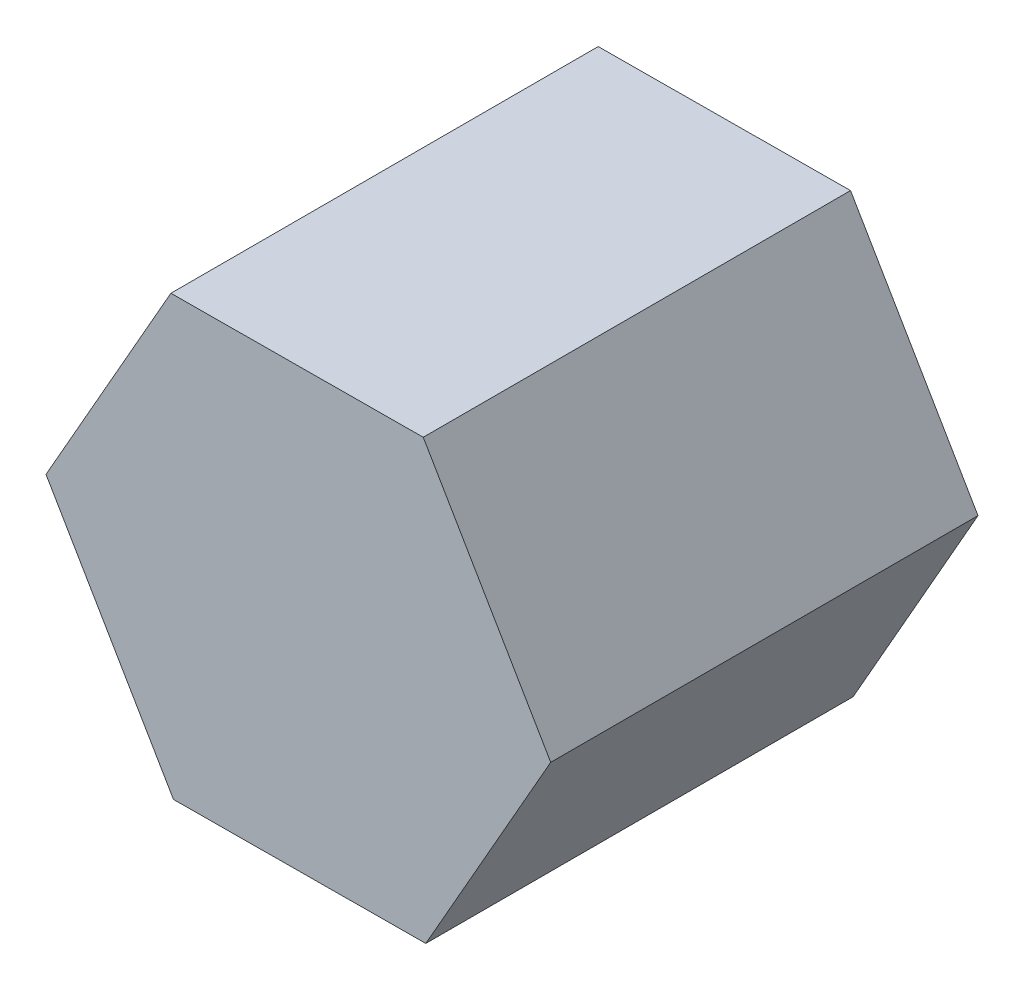
ISO-10303-21;
HEADER;
FILE_DESCRIPTION(('STEP AP214'),'2;1');
FILE_NAME('part.step','',(''),(''),'','','');
FILE_SCHEMA(('AUTOMOTIVE_DESIGN { 1 0 10303 214 1 1 1 1 }'));
ENDSEC;
DATA;
#1=APPLICATION_CONTEXT('core data for automotive mechanical design processes');
#2=APPLICATION_PROTOCOL_DEFINITION('international standard','automotive_design',2000,#1);
#3=PRODUCT_CONTEXT('',#1,'mechanical');
#4=PRODUCT('Part','Part','',(#3));
#5=PRODUCT_RELATED_PRODUCT_CATEGORY('part','',(#4));
#6=PRODUCT_DEFINITION_FORMATION('','',#4);
#7=PRODUCT_DEFINITION_CONTEXT('part definition',#1,'design');
#8=PRODUCT_DEFINITION('design','',#6,#7);
#9=PRODUCT_DEFINITION_SHAPE('','',#8);
#10=(LENGTH_UNIT() NAMED_UNIT(*) SI_UNIT(.MILLI.,.METRE.));
#11=(NAMED_UNIT(*) PLANE_ANGLE_UNIT() SI_UNIT($,.RADIAN.));
#12=(NAMED_UNIT(*) SI_UNIT($,.STERADIAN.) SOLID_ANGLE_UNIT());
#13=UNCERTAINTY_MEASURE_WITH_UNIT(LENGTH_MEASURE(1.E-05),#10,'distance_accuracy_value','');
#14=(GEOMETRIC_REPRESENTATION_CONTEXT(3) GLOBAL_UNCERTAINTY_ASSIGNED_CONTEXT((#13)) GLOBAL_UNIT_ASSIGNED_CONTEXT((#10,
#11,#12)) REPRESENTATION_CONTEXT('',''));
#15=CARTESIAN_POINT('',(0.,0.,0.));
#16=DIRECTION('',(0.,0.,1.));
#17=DIRECTION('',(1.,0.,0.));
#18=AXIS2_PLACEMENT_3D('',#15,#16,#17);
#19=CARTESIAN_POINT('',(46.7699203692853,82.114703608128,160.));
#20=DIRECTION('',(0.00585621832050526,-0.999982852206468,0.));
#21=DIRECTION('',(0.999982852206468,0.00585621832050526,0.));
#22=AXIS2_PLACEMENT_3D('',#19,#20,#21);
#23=PLANE('',#22);
#24=DIRECTION('',(-0.999982852206468,-0.00585621832050526,0.));
#25=VECTOR('',#24,1.);
#26=CARTESIAN_POINT('',(46.7699203692853,82.114703608128,0.));
#27=LINE('',#26,#25);
#28=CARTESIAN_POINT('',(46.7699203692853,82.114703608128,0.));
#29=VERTEX_POINT('',#28);
#30=CARTESIAN_POINT('',(-47.728459164226,81.5612909768403,0.));
#31=VERTEX_POINT('',#30);
#32=EDGE_CURVE('E117',#29,#31,#27,.T.);
#33=ORIENTED_EDGE('',*,*,#32,.T.);
#34=DIRECTION('',(0.,0.,-1.));
#35=VECTOR('',#34,1.);
#36=CARTESIAN_POINT('',(-47.728459164226,81.5612909768403,160.));
#37=LINE('',#36,#35);
#38=CARTESIAN_POINT('',(-47.728459164226,81.5612909768403,160.));
#39=VERTEX_POINT('',#38);
#40=EDGE_CURVE('E11',#39,#31,#37,.T.);
#41=ORIENTED_EDGE('',*,*,#40,.F.);
#42=DIRECTION('',(-0.999982852206468,-0.00585621832050526,0.));
#43=VECTOR('',#42,1.);
#44=CARTESIAN_POINT('',(46.7699203692853,82.114703608128,160.));
#45=LINE('',#44,#43);
#46=CARTESIAN_POINT('',(46.7699203692853,82.114703608128,160.));
#47=VERTEX_POINT('',#46);
#48=EDGE_CURVE('E127',#47,#39,#45,.T.);
#49=ORIENTED_EDGE('',*,*,#48,.F.);
#50=DIRECTION('',(0.,0.,-1.));
#51=VECTOR('',#50,1.);
#52=CARTESIAN_POINT('',(46.7699203692853,82.114703608128,160.));
#53=LINE('',#52,#51);
#54=EDGE_CURVE('E113',#47,#29,#53,.T.);
#55=ORIENTED_EDGE('',*,*,#54,.T.);
#56=EDGE_LOOP('',(#33,#41,#49,#55));
#57=FACE_BOUND('',#56,.T.);
#58=ADVANCED_FACE('F33',(#57),#23,.F.);
#59=CARTESIAN_POINT('',(-47.728459164226,81.5612909768403,160.));
#60=DIRECTION('',(0.868938662519874,-0.494919792267568,0.));
#61=DIRECTION('',(0.494919792267568,0.868938662519874,0.));
#62=AXIS2_PLACEMENT_3D('',#59,#60,#61);
#63=PLANE('',#62);
#64=DIRECTION('',(-0.494919792267568,-0.868938662519874,0.));
#65=VECTOR('',#64,1.);
#66=CARTESIAN_POINT('',(-47.728459164226,81.5612909768403,0.));
#67=LINE('',#66,#65);
#68=CARTESIAN_POINT('',(-94.4983795335112,-0.553412631287775,0.));
#69=VERTEX_POINT('',#68);
#70=EDGE_CURVE('E120',#31,#69,#67,.T.);
#71=ORIENTED_EDGE('',*,*,#70,.T.);
#72=DIRECTION('',(0.,0.,-1.));
#73=VECTOR('',#72,1.);
#74=CARTESIAN_POINT('',(-94.4983795335112,-0.553412631287775,160.));
#75=LINE('',#74,#73);
#76=CARTESIAN_POINT('',(-94.4983795335112,-0.553412631287775,160.));
#77=VERTEX_POINT('',#76);
#78=EDGE_CURVE('E41',#77,#69,#75,.T.);
#79=ORIENTED_EDGE('',*,*,#78,.F.);
#80=DIRECTION('',(-0.494919792267568,-0.868938662519874,0.));
#81=VECTOR('',#80,1.);
#82=CARTESIAN_POINT('',(-47.728459164226,81.5612909768403,160.));
#83=LINE('',#82,#81);
#84=EDGE_CURVE('E86',#39,#77,#83,.T.);
#85=ORIENTED_EDGE('',*,*,#84,.F.);
#86=ORIENTED_EDGE('',*,*,#40,.T.);
#87=EDGE_LOOP('',(#71,#79,#85,#86));
#88=FACE_BOUND('',#87,.T.);
#89=ADVANCED_FACE('F151',(#88),#63,.F.);
#90=CARTESIAN_POINT('',(-94.4983795335112,-0.553412631287775,160.));
#91=DIRECTION('',(0.863082444199368,0.5050630599389,0.));
#92=DIRECTION('',(-0.5050630599389,0.863082444199368,0.));
#93=AXIS2_PLACEMENT_3D('',#90,#91,#92);
#94=PLANE('',#93);
#95=DIRECTION('',(0.5050630599389,-0.863082444199368,0.));
#96=VECTOR('',#95,1.);
#97=CARTESIAN_POINT('',(-94.4983795335112,-0.553412631287775,0.));
#98=LINE('',#97,#96);
#99=CARTESIAN_POINT('',(-46.7699203692851,-82.1147036081281,0.));
#100=VERTEX_POINT('',#99);
#101=EDGE_CURVE('E122',#69,#100,#98,.T.);
#102=ORIENTED_EDGE('',*,*,#101,.T.);
#103=DIRECTION('',(0.,0.,-1.));
#104=VECTOR('',#103,1.);
#105=CARTESIAN_POINT('',(-46.7699203692851,-82.1147036081281,160.));
#106=LINE('',#105,#104);
#107=CARTESIAN_POINT('',(-46.7699203692851,-82.1147036081281,160.));
#108=VERTEX_POINT('',#107);
#109=EDGE_CURVE('E108',#108,#100,#106,.T.);
#110=ORIENTED_EDGE('',*,*,#109,.F.);
#111=DIRECTION('',(0.5050630599389,-0.863082444199368,0.));
#112=VECTOR('',#111,1.);
#113=CARTESIAN_POINT('',(-94.4983795335112,-0.553412631287775,160.));
#114=LINE('',#113,#112);
#115=EDGE_CURVE('E99',#77,#108,#114,.T.);
#116=ORIENTED_EDGE('',*,*,#115,.F.);
#117=ORIENTED_EDGE('',*,*,#78,.T.);
#118=EDGE_LOOP('',(#102,#110,#116,#117));
#119=FACE_BOUND('',#118,.T.);
#120=ADVANCED_FACE('F133',(#119),#94,.F.);
#121=CARTESIAN_POINT('',(-46.7699203692851,-82.1147036081281,160.));
#122=DIRECTION('',(-0.00585621832050542,0.999982852206468,0.));
#123=DIRECTION('',(-0.999982852206468,-0.00585621832050542,0.));
#124=AXIS2_PLACEMENT_3D('',#121,#122,#123);
#125=PLANE('',#124);
#126=DIRECTION('',(0.999982852206468,0.00585621832050542,0.));
#127=VECTOR('',#126,1.);
#128=CARTESIAN_POINT('',(-46.7699203692851,-82.1147036081281,0.));
#129=LINE('',#128,#127);
#130=CARTESIAN_POINT('',(47.728459164226,-81.5612909768404,0.));
#131=VERTEX_POINT('',#130);
#132=EDGE_CURVE('E107',#100,#131,#129,.T.);
#133=ORIENTED_EDGE('',*,*,#132,.T.);
#134=DIRECTION('',(0.,0.,-1.));
#135=VECTOR('',#134,1.);
#136=CARTESIAN_POINT('',(47.728459164226,-81.5612909768404,160.));
#137=LINE('',#136,#135);
#138=CARTESIAN_POINT('',(47.728459164226,-81.5612909768404,160.));
#139=VERTEX_POINT('',#138);
#140=EDGE_CURVE('E104',#139,#131,#137,.T.);
#141=ORIENTED_EDGE('',*,*,#140,.F.);
#142=DIRECTION('',(0.999982852206468,0.00585621832050542,0.));
#143=VECTOR('',#142,1.);
#144=CARTESIAN_POINT('',(-46.7699203692851,-82.1147036081281,160.));
#145=LINE('',#144,#143);
#146=EDGE_CURVE('E93',#108,#139,#145,.T.);
#147=ORIENTED_EDGE('',*,*,#146,.F.);
#148=ORIENTED_EDGE('',*,*,#109,.T.);
#149=EDGE_LOOP('',(#133,#141,#147,#148));
#150=FACE_BOUND('',#149,.T.);
#151=ADVANCED_FACE('F105',(#150),#125,.F.);
#152=CARTESIAN_POINT('',(47.728459164226,-81.5612909768404,160.));
#153=DIRECTION('',(-0.868938662519874,0.494919792267568,0.));
#154=DIRECTION('',(-0.494919792267568,-0.868938662519874,0.));
#155=AXIS2_PLACEMENT_3D('',#152,#153,#154);
#156=PLANE('',#155);
#157=DIRECTION('',(0.494919792267568,0.868938662519874,0.));
#158=VECTOR('',#157,1.);
#159=CARTESIAN_POINT('',(47.728459164226,-81.5612909768404,0.));
#160=LINE('',#159,#158);
#161=CARTESIAN_POINT('',(94.4983795335113,0.553412631287772,0.));
#162=VERTEX_POINT('',#161);
#163=EDGE_CURVE('E72',#131,#162,#160,.T.);
#164=ORIENTED_EDGE('',*,*,#163,.T.);
#165=DIRECTION('',(0.,0.,-1.));
#166=VECTOR('',#165,1.);
#167=CARTESIAN_POINT('',(94.4983795335113,0.553412631287772,160.));
#168=LINE('',#167,#166);
#169=CARTESIAN_POINT('',(94.4983795335113,0.553412631287772,160.));
#170=VERTEX_POINT('',#169);
#171=EDGE_CURVE('E109',#170,#162,#168,.T.);
#172=ORIENTED_EDGE('',*,*,#171,.F.);
#173=DIRECTION('',(0.494919792267568,0.868938662519874,0.));
#174=VECTOR('',#173,1.);
#175=CARTESIAN_POINT('',(47.728459164226,-81.5612909768404,160.));
#176=LINE('',#175,#174);
#177=EDGE_CURVE('E97',#139,#170,#176,.T.);
#178=ORIENTED_EDGE('',*,*,#177,.F.);
#179=ORIENTED_EDGE('',*,*,#140,.T.);
#180=EDGE_LOOP('',(#164,#172,#178,#179));
#181=FACE_BOUND('',#180,.T.);
#182=ADVANCED_FACE('F111',(#181),#156,.F.);
#183=CARTESIAN_POINT('',(94.4983795335113,0.553412631287772,160.));
#184=DIRECTION('',(-0.863082444199368,-0.5050630599389,0.));
#185=DIRECTION('',(0.5050630599389,-0.863082444199368,0.));
#186=AXIS2_PLACEMENT_3D('',#183,#184,#185);
#187=PLANE('',#186);
#188=DIRECTION('',(-0.5050630599389,0.863082444199368,0.));
#189=VECTOR('',#188,1.);
#190=CARTESIAN_POINT('',(94.4983795335113,0.553412631287772,0.));
#191=LINE('',#190,#189);
#192=EDGE_CURVE('E78',#162,#29,#191,.T.);
#193=ORIENTED_EDGE('',*,*,#192,.T.);
#194=ORIENTED_EDGE('',*,*,#54,.F.);
#195=DIRECTION('',(-0.5050630599389,0.863082444199368,0.));
#196=VECTOR('',#195,1.);
#197=CARTESIAN_POINT('',(94.4983795335113,0.553412631287772,160.));
#198=LINE('',#197,#196);
#199=EDGE_CURVE('E49',#170,#47,#198,.T.);
#200=ORIENTED_EDGE('',*,*,#199,.F.);
#201=ORIENTED_EDGE('',*,*,#171,.T.);
#202=EDGE_LOOP('',(#193,#194,#200,#201));
#203=FACE_BOUND('',#202,.T.);
#204=ADVANCED_FACE('F140',(#203),#187,.F.);
#205=CARTESIAN_POINT('',(0.,0.,160.));
#206=DIRECTION('',(0.,0.,1.));
#207=DIRECTION('',(1.,0.,0.));
#208=AXIS2_PLACEMENT_3D('',#205,#206,#207);
#209=PLANE('',#208);
#210=ORIENTED_EDGE('',*,*,#48,.T.);
#211=ORIENTED_EDGE('',*,*,#84,.T.);
#212=ORIENTED_EDGE('',*,*,#115,.T.);
#213=ORIENTED_EDGE('',*,*,#146,.T.);
#214=ORIENTED_EDGE('',*,*,#177,.T.);
#215=ORIENTED_EDGE('',*,*,#199,.T.);
#216=EDGE_LOOP('',(#210,#211,#212,#213,#214,#215));
#217=FACE_BOUND('',#216,.T.);
#218=ADVANCED_FACE('F95',(#217),#209,.T.);
#219=CARTESIAN_POINT('',(0.,0.,0.));
#220=DIRECTION('',(0.,0.,1.));
#221=DIRECTION('',(1.,0.,0.));
#222=AXIS2_PLACEMENT_3D('',#219,#220,#221);
#223=PLANE('',#222);
#224=ORIENTED_EDGE('',*,*,#32,.F.);
#225=ORIENTED_EDGE('',*,*,#192,.F.);
#226=ORIENTED_EDGE('',*,*,#163,.F.);
#227=ORIENTED_EDGE('',*,*,#132,.F.);
#228=ORIENTED_EDGE('',*,*,#101,.F.);
#229=ORIENTED_EDGE('',*,*,#70,.F.);
#230=EDGE_LOOP('',(#224,#225,#226,#227,#228,#229));
#231=FACE_BOUND('',#230,.T.);
#232=ADVANCED_FACE('F136',(#231),#223,.F.);
#233=CLOSED_SHELL('',(#58,#89,#120,#151,#182,#204,#218,#232));
#234=MANIFOLD_SOLID_BREP('B2',#233);
#235=ADVANCED_BREP_SHAPE_REPRESENTATION('',(#18,#234),#14);
#236=SHAPE_DEFINITION_REPRESENTATION(#9,#235);
ENDSEC;
END-ISO-10303-21;
